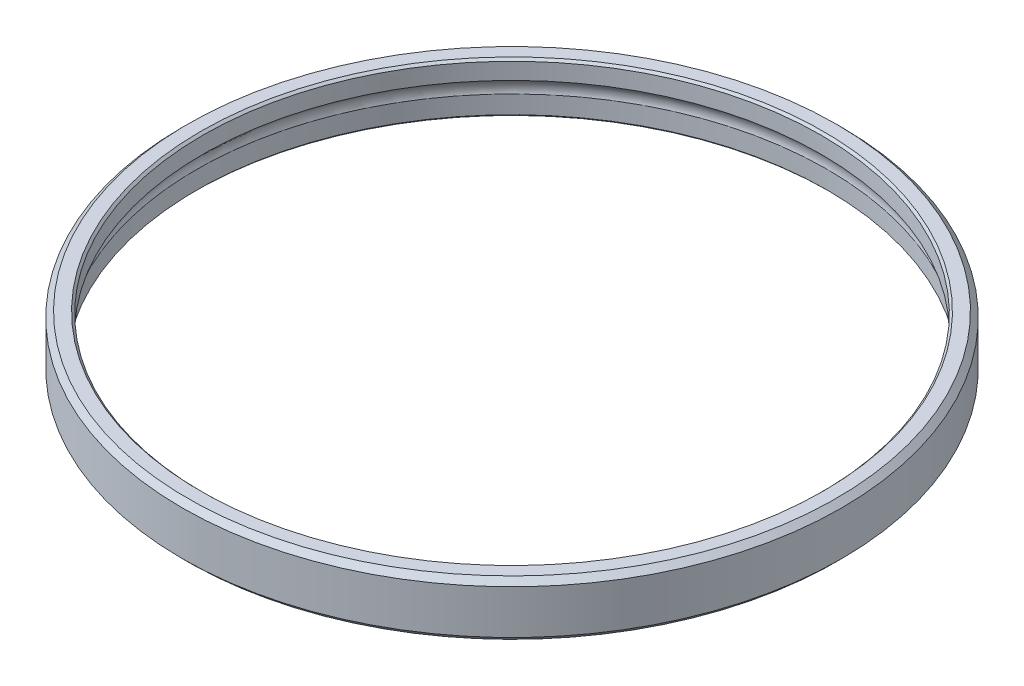
ISO-10303-21;
HEADER;
FILE_DESCRIPTION(('STEP AP214'),'2;1');
FILE_NAME('part.step','',(''),(''),'','','');
FILE_SCHEMA(('AUTOMOTIVE_DESIGN { 1 0 10303 214 1 1 1 1 }'));
ENDSEC;
DATA;
#1=APPLICATION_CONTEXT('core data for automotive mechanical design processes');
#2=APPLICATION_PROTOCOL_DEFINITION('international standard','automotive_design',2000,#1);
#3=PRODUCT_CONTEXT('',#1,'mechanical');
#4=PRODUCT('Part','Part','',(#3));
#5=PRODUCT_RELATED_PRODUCT_CATEGORY('part','',(#4));
#6=PRODUCT_DEFINITION_FORMATION('','',#4);
#7=PRODUCT_DEFINITION_CONTEXT('part definition',#1,'design');
#8=PRODUCT_DEFINITION('design','',#6,#7);
#9=PRODUCT_DEFINITION_SHAPE('','',#8);
#10=(LENGTH_UNIT() NAMED_UNIT(*) SI_UNIT(.MILLI.,.METRE.));
#11=(NAMED_UNIT(*) PLANE_ANGLE_UNIT() SI_UNIT($,.RADIAN.));
#12=(NAMED_UNIT(*) SI_UNIT($,.STERADIAN.) SOLID_ANGLE_UNIT());
#13=UNCERTAINTY_MEASURE_WITH_UNIT(LENGTH_MEASURE(1.E-05),#10,'distance_accuracy_value','');
#14=(GEOMETRIC_REPRESENTATION_CONTEXT(3) GLOBAL_UNCERTAINTY_ASSIGNED_CONTEXT((#13)) GLOBAL_UNIT_ASSIGNED_CONTEXT((#10,
#11,#12)) REPRESENTATION_CONTEXT('',''));
#15=CARTESIAN_POINT('',(0.,0.,0.));
#16=DIRECTION('',(0.,0.,1.));
#17=DIRECTION('',(1.,0.,0.));
#18=AXIS2_PLACEMENT_3D('',#15,#16,#17);
#19=CARTESIAN_POINT('',(0.,0.,0.));
#20=DIRECTION('',(0.,-1.,0.));
#21=DIRECTION('',(0.,0.,-1.));
#22=AXIS2_PLACEMENT_3D('',#19,#20,#21);
#23=TOROIDAL_SURFACE('',#22,34.925,1.5875);
#24=CARTESIAN_POINT('',(0.,-0.485930612330603,0.));
#25=DIRECTION('',(0.,1.,0.));
#26=DIRECTION('',(0.,0.,1.));
#27=AXIS2_PLACEMENT_3D('',#24,#25,#26);
#28=CIRCLE('',#27,36.4363);
#29=CARTESIAN_POINT('',(0.,-0.485930612330603,36.4363));
#30=VERTEX_POINT('',#29);
#31=EDGE_CURVE('E37',#30,#30,#28,.F.);
#32=ORIENTED_EDGE('',*,*,#31,.T.);
#33=EDGE_LOOP('',(#32));
#34=FACE_BOUND('',#33,.T.);
#35=CARTESIAN_POINT('',(0.,1.36363939881481,0.));
#36=DIRECTION('',(0.,-1.,0.));
#37=DIRECTION('',(0.,0.,-1.));
#38=AXIS2_PLACEMENT_3D('',#35,#36,#37);
#39=CIRCLE('',#38,35.7378);
#40=CARTESIAN_POINT('',(0.,1.36363939881481,-35.7378));
#41=VERTEX_POINT('',#40);
#42=EDGE_CURVE('E39',#41,#41,#39,.F.);
#43=ORIENTED_EDGE('',*,*,#42,.T.);
#44=EDGE_LOOP('',(#43));
#45=FACE_BOUND('',#44,.T.);
#46=ADVANCED_FACE('F15',(#34,#45),#23,.F.);
#47=CARTESIAN_POINT('',(0.,0.,0.));
#48=DIRECTION('',(0.,-1.,0.));
#49=DIRECTION('',(0.,0.,-1.));
#50=AXIS2_PLACEMENT_3D('',#47,#48,#49);
#51=CYLINDRICAL_SURFACE('',#50,35.7378);
#52=ORIENTED_EDGE('',*,*,#42,.F.);
#53=EDGE_LOOP('',(#52));
#54=FACE_BOUND('',#53,.T.);
#55=CARTESIAN_POINT('',(0.,3.2766,0.));
#56=DIRECTION('',(0.,1.,0.));
#57=DIRECTION('',(0.,0.,1.));
#58=AXIS2_PLACEMENT_3D('',#55,#56,#57);
#59=CIRCLE('',#58,35.7378);
#60=CARTESIAN_POINT('',(0.,3.2766,35.7378));
#61=VERTEX_POINT('',#60);
#62=EDGE_CURVE('E34',#61,#61,#59,.T.);
#63=ORIENTED_EDGE('',*,*,#62,.T.);
#64=EDGE_LOOP('',(#63));
#65=FACE_BOUND('',#64,.T.);
#66=ADVANCED_FACE('F138',(#54,#65),#51,.F.);
#67=CARTESIAN_POINT('',(0.,0.,0.));
#68=DIRECTION('',(0.,1.,0.));
#69=DIRECTION('',(0.,0.,1.));
#70=AXIS2_PLACEMENT_3D('',#67,#68,#69);
#71=CYLINDRICAL_SURFACE('',#70,36.4363);
#72=ORIENTED_EDGE('',*,*,#31,.F.);
#73=EDGE_LOOP('',(#72));
#74=FACE_BOUND('',#73,.T.);
#75=CARTESIAN_POINT('',(0.,-2.5654,0.));
#76=DIRECTION('',(0.,-1.,0.));
#77=DIRECTION('',(0.,0.,-1.));
#78=AXIS2_PLACEMENT_3D('',#75,#76,#77);
#79=CIRCLE('',#78,36.4363);
#80=CARTESIAN_POINT('',(0.,-2.5654,-36.4363));
#81=VERTEX_POINT('',#80);
#82=EDGE_CURVE('E31',#81,#81,#79,.T.);
#83=ORIENTED_EDGE('',*,*,#82,.T.);
#84=EDGE_LOOP('',(#83));
#85=FACE_BOUND('',#84,.T.);
#86=ADVANCED_FACE('F129',(#74,#85),#71,.F.);
#87=CARTESIAN_POINT('',(0.,3.5306,0.));
#88=DIRECTION('',(0.,1.,0.));
#89=DIRECTION('',(-1.,0.,0.));
#90=AXIS2_PLACEMENT_3D('',#87,#88,#89);
#91=CONICAL_SURFACE('',#90,35.9918,0.785398163397447);
#92=CARTESIAN_POINT('',(0.,3.5306,0.));
#93=DIRECTION('',(0.,1.,0.));
#94=DIRECTION('',(-1.,0.,0.));
#95=AXIS2_PLACEMENT_3D('',#92,#93,#94);
#96=CIRCLE('',#95,35.9918);
#97=CARTESIAN_POINT('',(-35.9918,3.5306,0.));
#98=VERTEX_POINT('',#97);
#99=EDGE_CURVE('E19',#98,#98,#96,.T.);
#100=ORIENTED_EDGE('',*,*,#99,.T.);
#101=EDGE_LOOP('',(#100));
#102=FACE_BOUND('',#101,.T.);
#103=ORIENTED_EDGE('',*,*,#62,.F.);
#104=EDGE_LOOP('',(#103));
#105=FACE_BOUND('',#104,.T.);
#106=ADVANCED_FACE('F55',(#102,#105),#91,.F.);
#107=CARTESIAN_POINT('',(0.,-2.8194,0.));
#108=DIRECTION('',(0.,-1.,0.));
#109=DIRECTION('',(0.,0.,-1.));
#110=AXIS2_PLACEMENT_3D('',#107,#108,#109);
#111=CONICAL_SURFACE('',#110,36.6903,0.785398163397437);
#112=CARTESIAN_POINT('',(0.,-2.8194,0.));
#113=DIRECTION('',(0.,-1.,0.));
#114=DIRECTION('',(0.,0.,-1.));
#115=AXIS2_PLACEMENT_3D('',#112,#113,#114);
#116=CIRCLE('',#115,36.6903);
#117=CARTESIAN_POINT('',(0.,-2.8194,-36.6903));
#118=VERTEX_POINT('',#117);
#119=EDGE_CURVE('E48',#118,#118,#116,.T.);
#120=ORIENTED_EDGE('',*,*,#119,.T.);
#121=EDGE_LOOP('',(#120));
#122=FACE_BOUND('',#121,.T.);
#123=ORIENTED_EDGE('',*,*,#82,.F.);
#124=EDGE_LOOP('',(#123));
#125=FACE_BOUND('',#124,.T.);
#126=ADVANCED_FACE('F62',(#122,#125),#111,.F.);
#127=CARTESIAN_POINT('',(-35.7378,3.5306,0.));
#128=DIRECTION('',(0.,-1.,0.));
#129=DIRECTION('',(0.,0.,-1.));
#130=AXIS2_PLACEMENT_3D('',#127,#128,#129);
#131=PLANE('',#130);
#132=ORIENTED_EDGE('',*,*,#99,.F.);
#133=EDGE_LOOP('',(#132));
#134=FACE_BOUND('',#133,.T.);
#135=CARTESIAN_POINT('',(0.,3.5306,0.));
#136=DIRECTION('',(0.,-1.,0.));
#137=DIRECTION('',(0.,0.,-1.));
#138=AXIS2_PLACEMENT_3D('',#135,#136,#137);
#139=CIRCLE('',#138,37.465);
#140=CARTESIAN_POINT('',(0.,3.5306,-37.465));
#141=VERTEX_POINT('',#140);
#142=EDGE_CURVE('E46',#141,#141,#139,.T.);
#143=ORIENTED_EDGE('',*,*,#142,.F.);
#144=EDGE_LOOP('',(#143));
#145=FACE_BOUND('',#144,.T.);
#146=ADVANCED_FACE('F58',(#134,#145),#131,.F.);
#147=CARTESIAN_POINT('',(-35.7378,-2.8194,0.));
#148=DIRECTION('',(0.,1.,0.));
#149=DIRECTION('',(0.,0.,1.));
#150=AXIS2_PLACEMENT_3D('',#147,#148,#149);
#151=PLANE('',#150);
#152=ORIENTED_EDGE('',*,*,#119,.F.);
#153=EDGE_LOOP('',(#152));
#154=FACE_BOUND('',#153,.T.);
#155=CARTESIAN_POINT('',(0.,-2.8194,0.));
#156=DIRECTION('',(0.,1.,0.));
#157=DIRECTION('',(-1.,0.,0.));
#158=AXIS2_PLACEMENT_3D('',#155,#156,#157);
#159=CIRCLE('',#158,37.465);
#160=CARTESIAN_POINT('',(-37.465,-2.8194,0.));
#161=VERTEX_POINT('',#160);
#162=EDGE_CURVE('E28',#161,#161,#159,.T.);
#163=ORIENTED_EDGE('',*,*,#162,.F.);
#164=EDGE_LOOP('',(#163));
#165=FACE_BOUND('',#164,.T.);
#166=ADVANCED_FACE('F61',(#154,#165),#151,.F.);
#167=CARTESIAN_POINT('',(0.,2.8956,0.));
#168=DIRECTION('',(0.,-1.,0.));
#169=DIRECTION('',(0.,0.,-1.));
#170=AXIS2_PLACEMENT_3D('',#167,#168,#169);
#171=CONICAL_SURFACE('',#170,38.1,0.785398163397447);
#172=CARTESIAN_POINT('',(0.,2.8956,0.));
#173=DIRECTION('',(0.,-1.,0.));
#174=DIRECTION('',(0.,0.,-1.));
#175=AXIS2_PLACEMENT_3D('',#172,#173,#174);
#176=CIRCLE('',#175,38.1);
#177=CARTESIAN_POINT('',(0.,2.8956,-38.1));
#178=VERTEX_POINT('',#177);
#179=EDGE_CURVE('E23',#178,#178,#176,.T.);
#180=ORIENTED_EDGE('',*,*,#179,.F.);
#181=EDGE_LOOP('',(#180));
#182=FACE_BOUND('',#181,.T.);
#183=ORIENTED_EDGE('',*,*,#142,.T.);
#184=EDGE_LOOP('',(#183));
#185=FACE_BOUND('',#184,.T.);
#186=ADVANCED_FACE('F66',(#182,#185),#171,.T.);
#187=CARTESIAN_POINT('',(0.,-2.18439999999999,0.));
#188=DIRECTION('',(0.,1.,0.));
#189=DIRECTION('',(-1.,0.,0.));
#190=AXIS2_PLACEMENT_3D('',#187,#188,#189);
#191=CONICAL_SURFACE('',#190,38.1,0.78539816339745);
#192=CARTESIAN_POINT('',(0.,-2.1844,0.));
#193=DIRECTION('',(0.,-1.,0.));
#194=DIRECTION('',(0.,0.,-1.));
#195=AXIS2_PLACEMENT_3D('',#192,#193,#194);
#196=CIRCLE('',#195,38.1);
#197=CARTESIAN_POINT('',(0.,-2.1844,-38.1));
#198=VERTEX_POINT('',#197);
#199=EDGE_CURVE('E10',#198,#198,#196,.F.);
#200=ORIENTED_EDGE('',*,*,#199,.F.);
#201=EDGE_LOOP('',(#200));
#202=FACE_BOUND('',#201,.T.);
#203=ORIENTED_EDGE('',*,*,#162,.T.);
#204=EDGE_LOOP('',(#203));
#205=FACE_BOUND('',#204,.T.);
#206=ADVANCED_FACE('F68',(#202,#205),#191,.T.);
#207=CARTESIAN_POINT('',(0.,0.,0.));
#208=DIRECTION('',(0.,-1.,0.));
#209=DIRECTION('',(0.,0.,-1.));
#210=AXIS2_PLACEMENT_3D('',#207,#208,#209);
#211=CYLINDRICAL_SURFACE('',#210,38.1);
#212=ORIENTED_EDGE('',*,*,#199,.T.);
#213=EDGE_LOOP('',(#212));
#214=FACE_BOUND('',#213,.T.);
#215=ORIENTED_EDGE('',*,*,#179,.T.);
#216=EDGE_LOOP('',(#215));
#217=FACE_BOUND('',#216,.T.);
#218=ADVANCED_FACE('F76',(#214,#217),#211,.T.);
#219=CLOSED_SHELL('',(#46,#66,#86,#106,#126,#146,#166,#186,#206,#218));
#220=MANIFOLD_SOLID_BREP('B1',#219);
#221=ADVANCED_BREP_SHAPE_REPRESENTATION('',(#18,#220),#14);
#222=SHAPE_DEFINITION_REPRESENTATION(#9,#221);
ENDSEC;
END-ISO-10303-21;
